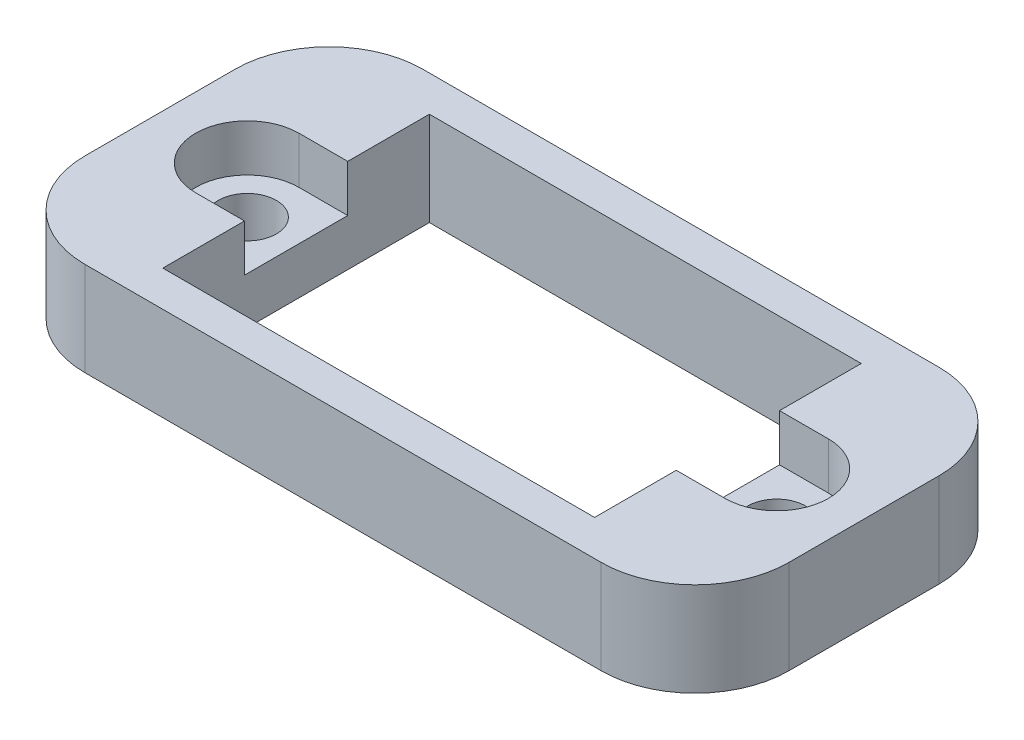
ISO-10303-21;
HEADER;
FILE_DESCRIPTION(('STEP AP214'),'2;1');
FILE_NAME('part.step','',(''),(''),'','','');
FILE_SCHEMA(('AUTOMOTIVE_DESIGN { 1 0 10303 214 1 1 1 1 }'));
ENDSEC;
DATA;
#1=APPLICATION_CONTEXT('core data for automotive mechanical design processes');
#2=APPLICATION_PROTOCOL_DEFINITION('international standard','automotive_design',2000,#1);
#3=PRODUCT_CONTEXT('',#1,'mechanical');
#4=PRODUCT('Part','Part','',(#3));
#5=PRODUCT_RELATED_PRODUCT_CATEGORY('part','',(#4));
#6=PRODUCT_DEFINITION_FORMATION('','',#4);
#7=PRODUCT_DEFINITION_CONTEXT('part definition',#1,'design');
#8=PRODUCT_DEFINITION('design','',#6,#7);
#9=PRODUCT_DEFINITION_SHAPE('','',#8);
#10=(LENGTH_UNIT() NAMED_UNIT(*) SI_UNIT(.MILLI.,.METRE.));
#11=(NAMED_UNIT(*) PLANE_ANGLE_UNIT() SI_UNIT($,.RADIAN.));
#12=(NAMED_UNIT(*) SI_UNIT($,.STERADIAN.) SOLID_ANGLE_UNIT());
#13=UNCERTAINTY_MEASURE_WITH_UNIT(LENGTH_MEASURE(1.E-05),#10,'distance_accuracy_value','');
#14=(GEOMETRIC_REPRESENTATION_CONTEXT(3) GLOBAL_UNCERTAINTY_ASSIGNED_CONTEXT((#13)) GLOBAL_UNIT_ASSIGNED_CONTEXT((#10,
#11,#12)) REPRESENTATION_CONTEXT('',''));
#15=CARTESIAN_POINT('',(0.,0.,0.));
#16=DIRECTION('',(0.,0.,1.));
#17=DIRECTION('',(1.,0.,0.));
#18=AXIS2_PLACEMENT_3D('',#15,#16,#17);
#19=CARTESIAN_POINT('',(-14.1,5.,0.));
#20=DIRECTION('',(0.,-1.,0.));
#21=DIRECTION('',(0.,0.,-1.));
#22=AXIS2_PLACEMENT_3D('',#19,#20,#21);
#23=CYLINDRICAL_SURFACE('',#22,1.55);
#24=CARTESIAN_POINT('',(-14.1,0.,0.));
#25=DIRECTION('',(0.,1.,0.));
#26=DIRECTION('',(0.,0.,1.));
#27=AXIS2_PLACEMENT_3D('',#24,#25,#26);
#28=CIRCLE('',#27,1.55);
#29=CARTESIAN_POINT('',(-14.1,0.,1.55));
#30=VERTEX_POINT('',#29);
#31=EDGE_CURVE('E266',#30,#30,#28,.T.);
#32=ORIENTED_EDGE('',*,*,#31,.F.);
#33=EDGE_LOOP('',(#32));
#34=FACE_BOUND('',#33,.T.);
#35=CARTESIAN_POINT('',(-14.1,2.5,0.));
#36=DIRECTION('',(0.,1.,0.));
#37=DIRECTION('',(0.,0.,1.));
#38=AXIS2_PLACEMENT_3D('',#35,#36,#37);
#39=CIRCLE('',#38,1.55);
#40=CARTESIAN_POINT('',(-14.1,2.5,1.55));
#41=VERTEX_POINT('',#40);
#42=EDGE_CURVE('E234',#41,#41,#39,.F.);
#43=ORIENTED_EDGE('',*,*,#42,.F.);
#44=EDGE_LOOP('',(#43));
#45=FACE_BOUND('',#44,.T.);
#46=ADVANCED_FACE('F39',(#34,#45),#23,.F.);
#47=CARTESIAN_POINT('',(14.1,5.,0.));
#48=DIRECTION('',(0.,-1.,0.));
#49=DIRECTION('',(0.,0.,-1.));
#50=AXIS2_PLACEMENT_3D('',#47,#48,#49);
#51=CYLINDRICAL_SURFACE('',#50,1.55);
#52=CARTESIAN_POINT('',(14.1,0.,0.));
#53=DIRECTION('',(0.,1.,0.));
#54=DIRECTION('',(0.,0.,1.));
#55=AXIS2_PLACEMENT_3D('',#52,#53,#54);
#56=CIRCLE('',#55,1.55);
#57=CARTESIAN_POINT('',(14.1,0.,1.55));
#58=VERTEX_POINT('',#57);
#59=EDGE_CURVE('E262',#58,#58,#56,.T.);
#60=ORIENTED_EDGE('',*,*,#59,.F.);
#61=EDGE_LOOP('',(#60));
#62=FACE_BOUND('',#61,.T.);
#63=CARTESIAN_POINT('',(14.1,2.5,0.));
#64=DIRECTION('',(0.,1.,0.));
#65=DIRECTION('',(0.,0.,1.));
#66=AXIS2_PLACEMENT_3D('',#63,#64,#65);
#67=CIRCLE('',#66,1.55);
#68=CARTESIAN_POINT('',(14.1,2.5,1.55));
#69=VERTEX_POINT('',#68);
#70=EDGE_CURVE('E209',#69,#69,#67,.F.);
#71=ORIENTED_EDGE('',*,*,#70,.F.);
#72=EDGE_LOOP('',(#71));
#73=FACE_BOUND('',#72,.T.);
#74=ADVANCED_FACE('F429',(#62,#73),#51,.F.);
#75=CARTESIAN_POINT('',(0.,5.,0.));
#76=DIRECTION('',(0.,-1.,0.));
#77=DIRECTION('',(0.,0.,-1.));
#78=AXIS2_PLACEMENT_3D('',#75,#76,#77);
#79=PLANE('',#78);
#80=DIRECTION('',(-1.,0.,0.));
#81=VECTOR('',#80,1.);
#82=CARTESIAN_POINT('',(-18.75,5.,-9.));
#83=LINE('',#82,#81);
#84=CARTESIAN_POINT('',(13.75,5.,-9.));
#85=VERTEX_POINT('',#84);
#86=CARTESIAN_POINT('',(-13.75,5.,-9.));
#87=VERTEX_POINT('',#86);
#88=EDGE_CURVE('E320',#85,#87,#83,.T.);
#89=ORIENTED_EDGE('',*,*,#88,.T.);
#90=CARTESIAN_POINT('',(-13.75,5.,-4.));
#91=DIRECTION('',(0.,-1.,0.));
#92=DIRECTION('',(0.,0.,-1.));
#93=AXIS2_PLACEMENT_3D('',#90,#91,#92);
#94=CIRCLE('',#93,5.);
#95=CARTESIAN_POINT('',(-18.75,5.,-4.));
#96=VERTEX_POINT('',#95);
#97=EDGE_CURVE('E378',#87,#96,#94,.F.);
#98=ORIENTED_EDGE('',*,*,#97,.T.);
#99=DIRECTION('',(0.,0.,1.));
#100=VECTOR('',#99,1.);
#101=CARTESIAN_POINT('',(-18.75,5.,9.));
#102=LINE('',#101,#100);
#103=CARTESIAN_POINT('',(-18.75,5.,4.));
#104=VERTEX_POINT('',#103);
#105=EDGE_CURVE('E325',#96,#104,#102,.T.);
#106=ORIENTED_EDGE('',*,*,#105,.T.);
#107=CARTESIAN_POINT('',(-13.75,5.,4.));
#108=DIRECTION('',(0.,-1.,0.));
#109=DIRECTION('',(0.,0.,-1.));
#110=AXIS2_PLACEMENT_3D('',#107,#108,#109);
#111=CIRCLE('',#110,5.);
#112=CARTESIAN_POINT('',(-13.75,5.,9.));
#113=VERTEX_POINT('',#112);
#114=EDGE_CURVE('E62',#104,#113,#111,.F.);
#115=ORIENTED_EDGE('',*,*,#114,.T.);
#116=DIRECTION('',(1.,0.,0.));
#117=VECTOR('',#116,1.);
#118=CARTESIAN_POINT('',(-18.75,5.,9.));
#119=LINE('',#118,#117);
#120=CARTESIAN_POINT('',(13.75,5.,9.));
#121=VERTEX_POINT('',#120);
#122=EDGE_CURVE('E328',#113,#121,#119,.T.);
#123=ORIENTED_EDGE('',*,*,#122,.T.);
#124=CARTESIAN_POINT('',(13.75,5.,4.));
#125=DIRECTION('',(0.,-1.,0.));
#126=DIRECTION('',(0.,0.,-1.));
#127=AXIS2_PLACEMENT_3D('',#124,#125,#126);
#128=CIRCLE('',#127,5.);
#129=CARTESIAN_POINT('',(18.75,5.,4.));
#130=VERTEX_POINT('',#129);
#131=EDGE_CURVE('E370',#121,#130,#128,.F.);
#132=ORIENTED_EDGE('',*,*,#131,.T.);
#133=DIRECTION('',(0.,0.,-1.));
#134=VECTOR('',#133,1.);
#135=CARTESIAN_POINT('',(18.75,5.,9.));
#136=LINE('',#135,#134);
#137=CARTESIAN_POINT('',(18.75,5.,-4.));
#138=VERTEX_POINT('',#137);
#139=EDGE_CURVE('E316',#130,#138,#136,.T.);
#140=ORIENTED_EDGE('',*,*,#139,.T.);
#141=CARTESIAN_POINT('',(13.75,5.,-4.));
#142=DIRECTION('',(0.,-1.,0.));
#143=DIRECTION('',(0.,0.,-1.));
#144=AXIS2_PLACEMENT_3D('',#141,#142,#143);
#145=CIRCLE('',#144,5.);
#146=EDGE_CURVE('E373',#138,#85,#145,.F.);
#147=ORIENTED_EDGE('',*,*,#146,.T.);
#148=EDGE_LOOP('',(#89,#98,#106,#115,#123,#132,#140,#147));
#149=FACE_BOUND('',#148,.T.);
#150=DIRECTION('',(0.,0.,-1.));
#151=VECTOR('',#150,1.);
#152=CARTESIAN_POINT('',(11.5,5.,7.1));
#153=LINE('',#152,#151);
#154=CARTESIAN_POINT('',(11.5,5.,-2.75));
#155=VERTEX_POINT('',#154);
#156=CARTESIAN_POINT('',(11.5,5.,-7.1));
#157=VERTEX_POINT('',#156);
#158=EDGE_CURVE('E275',#155,#157,#153,.T.);
#159=ORIENTED_EDGE('',*,*,#158,.F.);
#160=DIRECTION('',(-1.,0.,0.));
#161=VECTOR('',#160,1.);
#162=CARTESIAN_POINT('',(0.,5.,-2.74999999999999));
#163=LINE('',#162,#161);
#164=CARTESIAN_POINT('',(14.1,5.,-2.75));
#165=VERTEX_POINT('',#164);
#166=EDGE_CURVE('E201',#165,#155,#163,.T.);
#167=ORIENTED_EDGE('',*,*,#166,.F.);
#168=CARTESIAN_POINT('',(14.1,5.,0.));
#169=DIRECTION('',(0.,1.,0.));
#170=DIRECTION('',(0.,0.,1.));
#171=AXIS2_PLACEMENT_3D('',#168,#169,#170);
#172=CIRCLE('',#171,2.75);
#173=CARTESIAN_POINT('',(14.1,5.,2.74999999999999));
#174=VERTEX_POINT('',#173);
#175=EDGE_CURVE('E635',#174,#165,#172,.T.);
#176=ORIENTED_EDGE('',*,*,#175,.F.);
#177=DIRECTION('',(-1.,0.,0.));
#178=VECTOR('',#177,1.);
#179=CARTESIAN_POINT('',(0.,5.,2.75000000000002));
#180=LINE('',#179,#178);
#181=CARTESIAN_POINT('',(11.5,5.,2.75));
#182=VERTEX_POINT('',#181);
#183=EDGE_CURVE('E253',#174,#182,#180,.T.);
#184=ORIENTED_EDGE('',*,*,#183,.T.);
#185=CARTESIAN_POINT('',(11.5,5.,7.1));
#186=VERTEX_POINT('',#185);
#187=EDGE_CURVE('E207',#186,#182,#153,.T.);
#188=ORIENTED_EDGE('',*,*,#187,.F.);
#189=DIRECTION('',(1.,0.,0.));
#190=VECTOR('',#189,1.);
#191=CARTESIAN_POINT('',(-11.5,5.,7.1));
#192=LINE('',#191,#190);
#193=CARTESIAN_POINT('',(-11.5,5.,7.1));
#194=VERTEX_POINT('',#193);
#195=EDGE_CURVE('E283',#194,#186,#192,.T.);
#196=ORIENTED_EDGE('',*,*,#195,.F.);
#197=DIRECTION('',(0.,0.,1.));
#198=VECTOR('',#197,1.);
#199=CARTESIAN_POINT('',(-11.5,5.,7.1));
#200=LINE('',#199,#198);
#201=CARTESIAN_POINT('',(-11.5,5.,2.75));
#202=VERTEX_POINT('',#201);
#203=EDGE_CURVE('E278',#202,#194,#200,.T.);
#204=ORIENTED_EDGE('',*,*,#203,.F.);
#205=DIRECTION('',(1.,0.,0.));
#206=VECTOR('',#205,1.);
#207=CARTESIAN_POINT('',(0.,5.,2.75));
#208=LINE('',#207,#206);
#209=CARTESIAN_POINT('',(-14.1,5.,2.75));
#210=VERTEX_POINT('',#209);
#211=EDGE_CURVE('E224',#210,#202,#208,.T.);
#212=ORIENTED_EDGE('',*,*,#211,.F.);
#213=CARTESIAN_POINT('',(-14.1,5.,0.));
#214=DIRECTION('',(0.,1.,0.));
#215=DIRECTION('',(0.,0.,1.));
#216=AXIS2_PLACEMENT_3D('',#213,#214,#215);
#217=CIRCLE('',#216,2.75);
#218=CARTESIAN_POINT('',(-14.1,5.,-2.75));
#219=VERTEX_POINT('',#218);
#220=EDGE_CURVE('E243',#219,#210,#217,.T.);
#221=ORIENTED_EDGE('',*,*,#220,.F.);
#222=DIRECTION('',(1.,0.,0.));
#223=VECTOR('',#222,1.);
#224=CARTESIAN_POINT('',(0.,5.,-2.75));
#225=LINE('',#224,#223);
#226=CARTESIAN_POINT('',(-11.5,5.,-2.75));
#227=VERTEX_POINT('',#226);
#228=EDGE_CURVE('E239',#219,#227,#225,.T.);
#229=ORIENTED_EDGE('',*,*,#228,.T.);
#230=CARTESIAN_POINT('',(-11.5,5.,-7.1));
#231=VERTEX_POINT('',#230);
#232=EDGE_CURVE('E279',#231,#227,#200,.T.);
#233=ORIENTED_EDGE('',*,*,#232,.F.);
#234=DIRECTION('',(-1.,0.,0.));
#235=VECTOR('',#234,1.);
#236=CARTESIAN_POINT('',(-11.5,5.,-7.1));
#237=LINE('',#236,#235);
#238=EDGE_CURVE('E274',#157,#231,#237,.T.);
#239=ORIENTED_EDGE('',*,*,#238,.F.);
#240=EDGE_LOOP('',(#159,#167,#176,#184,#188,#196,#204,#212,#221,#229,#233,#239));
#241=FACE_BOUND('',#240,.T.);
#242=ADVANCED_FACE('F411',(#149,#241),#79,.F.);
#243=CARTESIAN_POINT('',(0.,0.,0.));
#244=DIRECTION('',(0.,-1.,0.));
#245=DIRECTION('',(0.,0.,-1.));
#246=AXIS2_PLACEMENT_3D('',#243,#244,#245);
#247=PLANE('',#246);
#248=ORIENTED_EDGE('',*,*,#31,.T.);
#249=EDGE_LOOP('',(#248));
#250=FACE_BOUND('',#249,.T.);
#251=DIRECTION('',(0.,0.,1.));
#252=VECTOR('',#251,1.);
#253=CARTESIAN_POINT('',(-18.75,0.,9.));
#254=LINE('',#253,#252);
#255=CARTESIAN_POINT('',(-18.75,0.,-4.));
#256=VERTEX_POINT('',#255);
#257=CARTESIAN_POINT('',(-18.75,0.,4.));
#258=VERTEX_POINT('',#257);
#259=EDGE_CURVE('E339',#256,#258,#254,.T.);
#260=ORIENTED_EDGE('',*,*,#259,.F.);
#261=CARTESIAN_POINT('',(-13.75,0.,-4.));
#262=DIRECTION('',(0.,-1.,0.));
#263=DIRECTION('',(0.,0.,-1.));
#264=AXIS2_PLACEMENT_3D('',#261,#262,#263);
#265=CIRCLE('',#264,5.);
#266=CARTESIAN_POINT('',(-13.75,0.,-9.));
#267=VERTEX_POINT('',#266);
#268=EDGE_CURVE('E360',#256,#267,#265,.T.);
#269=ORIENTED_EDGE('',*,*,#268,.T.);
#270=DIRECTION('',(-1.,0.,0.));
#271=VECTOR('',#270,1.);
#272=CARTESIAN_POINT('',(-18.75,0.,-9.));
#273=LINE('',#272,#271);
#274=CARTESIAN_POINT('',(13.75,0.,-9.));
#275=VERTEX_POINT('',#274);
#276=EDGE_CURVE('E335',#275,#267,#273,.T.);
#277=ORIENTED_EDGE('',*,*,#276,.F.);
#278=CARTESIAN_POINT('',(13.75,0.,-4.));
#279=DIRECTION('',(0.,-1.,0.));
#280=DIRECTION('',(0.,0.,-1.));
#281=AXIS2_PLACEMENT_3D('',#278,#279,#280);
#282=CIRCLE('',#281,5.);
#283=CARTESIAN_POINT('',(18.75,0.,-4.));
#284=VERTEX_POINT('',#283);
#285=EDGE_CURVE('E354',#275,#284,#282,.T.);
#286=ORIENTED_EDGE('',*,*,#285,.T.);
#287=DIRECTION('',(0.,0.,-1.));
#288=VECTOR('',#287,1.);
#289=CARTESIAN_POINT('',(18.75,0.,9.));
#290=LINE('',#289,#288);
#291=CARTESIAN_POINT('',(18.75,0.,4.));
#292=VERTEX_POINT('',#291);
#293=EDGE_CURVE('E315',#292,#284,#290,.T.);
#294=ORIENTED_EDGE('',*,*,#293,.F.);
#295=CARTESIAN_POINT('',(13.75,0.,4.));
#296=DIRECTION('',(0.,-1.,0.));
#297=DIRECTION('',(0.,0.,-1.));
#298=AXIS2_PLACEMENT_3D('',#295,#296,#297);
#299=CIRCLE('',#298,5.);
#300=CARTESIAN_POINT('',(13.75,0.,9.));
#301=VERTEX_POINT('',#300);
#302=EDGE_CURVE('E351',#292,#301,#299,.T.);
#303=ORIENTED_EDGE('',*,*,#302,.T.);
#304=DIRECTION('',(1.,0.,0.));
#305=VECTOR('',#304,1.);
#306=CARTESIAN_POINT('',(-18.75,0.,9.));
#307=LINE('',#306,#305);
#308=CARTESIAN_POINT('',(-13.75,0.,9.));
#309=VERTEX_POINT('',#308);
#310=EDGE_CURVE('E321',#309,#301,#307,.T.);
#311=ORIENTED_EDGE('',*,*,#310,.F.);
#312=CARTESIAN_POINT('',(-13.75,0.,4.));
#313=DIRECTION('',(0.,-1.,0.));
#314=DIRECTION('',(0.,0.,-1.));
#315=AXIS2_PLACEMENT_3D('',#312,#313,#314);
#316=CIRCLE('',#315,5.);
#317=EDGE_CURVE('E357',#309,#258,#316,.T.);
#318=ORIENTED_EDGE('',*,*,#317,.T.);
#319=EDGE_LOOP('',(#260,#269,#277,#286,#294,#303,#311,#318));
#320=FACE_BOUND('',#319,.T.);
#321=DIRECTION('',(1.,0.,0.));
#322=VECTOR('',#321,1.);
#323=CARTESIAN_POINT('',(-11.5,0.,7.1));
#324=LINE('',#323,#322);
#325=CARTESIAN_POINT('',(-11.5,0.,7.1));
#326=VERTEX_POINT('',#325);
#327=CARTESIAN_POINT('',(11.5,0.,7.1));
#328=VERTEX_POINT('',#327);
#329=EDGE_CURVE('E298',#326,#328,#324,.T.);
#330=ORIENTED_EDGE('',*,*,#329,.T.);
#331=DIRECTION('',(0.,0.,-1.));
#332=VECTOR('',#331,1.);
#333=CARTESIAN_POINT('',(11.5,0.,7.1));
#334=LINE('',#333,#332);
#335=CARTESIAN_POINT('',(11.5,0.,-7.1));
#336=VERTEX_POINT('',#335);
#337=EDGE_CURVE('E271',#328,#336,#334,.T.);
#338=ORIENTED_EDGE('',*,*,#337,.T.);
#339=DIRECTION('',(-1.,0.,0.));
#340=VECTOR('',#339,1.);
#341=CARTESIAN_POINT('',(-11.5,0.,-7.1));
#342=LINE('',#341,#340);
#343=CARTESIAN_POINT('',(-11.5,0.,-7.1));
#344=VERTEX_POINT('',#343);
#345=EDGE_CURVE('E290',#336,#344,#342,.T.);
#346=ORIENTED_EDGE('',*,*,#345,.T.);
#347=DIRECTION('',(0.,0.,1.));
#348=VECTOR('',#347,1.);
#349=CARTESIAN_POINT('',(-11.5,0.,7.1));
#350=LINE('',#349,#348);
#351=EDGE_CURVE('E294',#344,#326,#350,.T.);
#352=ORIENTED_EDGE('',*,*,#351,.T.);
#353=EDGE_LOOP('',(#330,#338,#346,#352));
#354=FACE_BOUND('',#353,.T.);
#355=ORIENTED_EDGE('',*,*,#59,.T.);
#356=EDGE_LOOP('',(#355));
#357=FACE_BOUND('',#356,.T.);
#358=ADVANCED_FACE('F398',(#250,#320,#354,#357),#247,.T.);
#359=CARTESIAN_POINT('',(18.75,5.,9.));
#360=DIRECTION('',(-1.,0.,0.));
#361=DIRECTION('',(0.,0.,1.));
#362=AXIS2_PLACEMENT_3D('',#359,#360,#361);
#363=PLANE('',#362);
#364=ORIENTED_EDGE('',*,*,#293,.T.);
#365=DIRECTION('',(0.,-1.,0.));
#366=VECTOR('',#365,1.);
#367=CARTESIAN_POINT('',(18.75,5.,-4.));
#368=LINE('',#367,#366);
#369=EDGE_CURVE('E11',#284,#138,#368,.F.);
#370=ORIENTED_EDGE('',*,*,#369,.T.);
#371=ORIENTED_EDGE('',*,*,#139,.F.);
#372=DIRECTION('',(0.,-1.,0.));
#373=VECTOR('',#372,1.);
#374=CARTESIAN_POINT('',(18.75,5.,4.));
#375=LINE('',#374,#373);
#376=EDGE_CURVE('E48',#130,#292,#375,.T.);
#377=ORIENTED_EDGE('',*,*,#376,.T.);
#378=EDGE_LOOP('',(#364,#370,#371,#377));
#379=FACE_BOUND('',#378,.T.);
#380=ADVANCED_FACE('F392',(#379),#363,.F.);
#381=CARTESIAN_POINT('',(-18.75,5.,-9.));
#382=DIRECTION('',(0.,0.,1.));
#383=DIRECTION('',(1.,0.,0.));
#384=AXIS2_PLACEMENT_3D('',#381,#382,#383);
#385=PLANE('',#384);
#386=ORIENTED_EDGE('',*,*,#276,.T.);
#387=DIRECTION('',(0.,-1.,0.));
#388=VECTOR('',#387,1.);
#389=CARTESIAN_POINT('',(-13.75,5.,-9.));
#390=LINE('',#389,#388);
#391=EDGE_CURVE('E367',#267,#87,#390,.F.);
#392=ORIENTED_EDGE('',*,*,#391,.T.);
#393=ORIENTED_EDGE('',*,*,#88,.F.);
#394=DIRECTION('',(0.,-1.,0.));
#395=VECTOR('',#394,1.);
#396=CARTESIAN_POINT('',(13.75,5.,-9.));
#397=LINE('',#396,#395);
#398=EDGE_CURVE('E363',#85,#275,#397,.T.);
#399=ORIENTED_EDGE('',*,*,#398,.T.);
#400=EDGE_LOOP('',(#386,#392,#393,#399));
#401=FACE_BOUND('',#400,.T.);
#402=ADVANCED_FACE('F408',(#401),#385,.F.);
#403=CARTESIAN_POINT('',(-18.75,5.,9.));
#404=DIRECTION('',(1.,0.,0.));
#405=DIRECTION('',(0.,0.,-1.));
#406=AXIS2_PLACEMENT_3D('',#403,#404,#405);
#407=PLANE('',#406);
#408=ORIENTED_EDGE('',*,*,#105,.F.);
#409=DIRECTION('',(0.,-1.,0.));
#410=VECTOR('',#409,1.);
#411=CARTESIAN_POINT('',(-18.75,5.,-4.));
#412=LINE('',#411,#410);
#413=EDGE_CURVE('E347',#96,#256,#412,.T.);
#414=ORIENTED_EDGE('',*,*,#413,.T.);
#415=ORIENTED_EDGE('',*,*,#259,.T.);
#416=DIRECTION('',(0.,-1.,0.));
#417=VECTOR('',#416,1.);
#418=CARTESIAN_POINT('',(-18.75,5.,4.));
#419=LINE('',#418,#417);
#420=EDGE_CURVE('E331',#258,#104,#419,.F.);
#421=ORIENTED_EDGE('',*,*,#420,.T.);
#422=EDGE_LOOP('',(#408,#414,#415,#421));
#423=FACE_BOUND('',#422,.T.);
#424=ADVANCED_FACE('F418',(#423),#407,.F.);
#425=CARTESIAN_POINT('',(-18.75,5.,9.));
#426=DIRECTION('',(0.,0.,-1.));
#427=DIRECTION('',(-1.,0.,0.));
#428=AXIS2_PLACEMENT_3D('',#425,#426,#427);
#429=PLANE('',#428);
#430=ORIENTED_EDGE('',*,*,#122,.F.);
#431=DIRECTION('',(0.,-1.,0.));
#432=VECTOR('',#431,1.);
#433=CARTESIAN_POINT('',(-13.75,5.,9.));
#434=LINE('',#433,#432);
#435=EDGE_CURVE('E383',#113,#309,#434,.T.);
#436=ORIENTED_EDGE('',*,*,#435,.T.);
#437=ORIENTED_EDGE('',*,*,#310,.T.);
#438=DIRECTION('',(0.,-1.,0.));
#439=VECTOR('',#438,1.);
#440=CARTESIAN_POINT('',(13.75,5.,9.));
#441=LINE('',#440,#439);
#442=EDGE_CURVE('E55',#301,#121,#441,.F.);
#443=ORIENTED_EDGE('',*,*,#442,.T.);
#444=EDGE_LOOP('',(#430,#436,#437,#443));
#445=FACE_BOUND('',#444,.T.);
#446=ADVANCED_FACE('F423',(#445),#429,.F.);
#447=CARTESIAN_POINT('',(11.5,5.,7.1));
#448=DIRECTION('',(-1.,0.,0.));
#449=DIRECTION('',(0.,0.,1.));
#450=AXIS2_PLACEMENT_3D('',#447,#448,#449);
#451=PLANE('',#450);
#452=DIRECTION('',(0.,1.,0.));
#453=VECTOR('',#452,1.);
#454=CARTESIAN_POINT('',(11.5,2.5,-2.75));
#455=LINE('',#454,#453);
#456=CARTESIAN_POINT('',(11.5,2.5,-2.75));
#457=VERTEX_POINT('',#456);
#458=EDGE_CURVE('E267',#457,#155,#455,.T.);
#459=ORIENTED_EDGE('',*,*,#458,.T.);
#460=ORIENTED_EDGE('',*,*,#158,.T.);
#461=DIRECTION('',(0.,-1.,0.));
#462=VECTOR('',#461,1.);
#463=CARTESIAN_POINT('',(11.5,5.,-7.1));
#464=LINE('',#463,#462);
#465=EDGE_CURVE('E311',#157,#336,#464,.T.);
#466=ORIENTED_EDGE('',*,*,#465,.T.);
#467=ORIENTED_EDGE('',*,*,#337,.F.);
#468=DIRECTION('',(0.,-1.,0.));
#469=VECTOR('',#468,1.);
#470=CARTESIAN_POINT('',(11.5,5.,7.1));
#471=LINE('',#470,#469);
#472=EDGE_CURVE('E286',#186,#328,#471,.T.);
#473=ORIENTED_EDGE('',*,*,#472,.F.);
#474=ORIENTED_EDGE('',*,*,#187,.T.);
#475=DIRECTION('',(0.,1.,0.));
#476=VECTOR('',#475,1.);
#477=CARTESIAN_POINT('',(11.5,2.5,2.75));
#478=LINE('',#477,#476);
#479=CARTESIAN_POINT('',(11.5,2.5,2.75));
#480=VERTEX_POINT('',#479);
#481=EDGE_CURVE('E182',#480,#182,#478,.T.);
#482=ORIENTED_EDGE('',*,*,#481,.F.);
#483=DIRECTION('',(0.,0.,1.));
#484=VECTOR('',#483,1.);
#485=CARTESIAN_POINT('',(11.5,2.5,0.));
#486=LINE('',#485,#484);
#487=EDGE_CURVE('E190',#457,#480,#486,.T.);
#488=ORIENTED_EDGE('',*,*,#487,.F.);
#489=EDGE_LOOP('',(#459,#460,#466,#467,#473,#474,#482,#488));
#490=FACE_BOUND('',#489,.T.);
#491=ADVANCED_FACE('F204',(#490),#451,.T.);
#492=CARTESIAN_POINT('',(-11.5,5.,-7.1));
#493=DIRECTION('',(0.,0.,1.));
#494=DIRECTION('',(1.,0.,0.));
#495=AXIS2_PLACEMENT_3D('',#492,#493,#494);
#496=PLANE('',#495);
#497=ORIENTED_EDGE('',*,*,#345,.F.);
#498=ORIENTED_EDGE('',*,*,#465,.F.);
#499=ORIENTED_EDGE('',*,*,#238,.T.);
#500=DIRECTION('',(0.,-1.,0.));
#501=VECTOR('',#500,1.);
#502=CARTESIAN_POINT('',(-11.5,5.,-7.1));
#503=LINE('',#502,#501);
#504=EDGE_CURVE('E308',#231,#344,#503,.T.);
#505=ORIENTED_EDGE('',*,*,#504,.T.);
#506=EDGE_LOOP('',(#497,#498,#499,#505));
#507=FACE_BOUND('',#506,.T.);
#508=ADVANCED_FACE('F449',(#507),#496,.T.);
#509=CARTESIAN_POINT('',(-11.5,5.,7.1));
#510=DIRECTION('',(1.,0.,0.));
#511=DIRECTION('',(0.,0.,-1.));
#512=AXIS2_PLACEMENT_3D('',#509,#510,#511);
#513=PLANE('',#512);
#514=DIRECTION('',(0.,1.,0.));
#515=VECTOR('',#514,1.);
#516=CARTESIAN_POINT('',(-11.5,2.5,2.75));
#517=LINE('',#516,#515);
#518=CARTESIAN_POINT('',(-11.5,2.5,2.75));
#519=VERTEX_POINT('',#518);
#520=EDGE_CURVE('E249',#519,#202,#517,.T.);
#521=ORIENTED_EDGE('',*,*,#520,.T.);
#522=ORIENTED_EDGE('',*,*,#203,.T.);
#523=DIRECTION('',(0.,-1.,0.));
#524=VECTOR('',#523,1.);
#525=CARTESIAN_POINT('',(-11.5,5.,7.1));
#526=LINE('',#525,#524);
#527=EDGE_CURVE('E305',#194,#326,#526,.T.);
#528=ORIENTED_EDGE('',*,*,#527,.T.);
#529=ORIENTED_EDGE('',*,*,#351,.F.);
#530=ORIENTED_EDGE('',*,*,#504,.F.);
#531=ORIENTED_EDGE('',*,*,#232,.T.);
#532=DIRECTION('',(0.,1.,0.));
#533=VECTOR('',#532,1.);
#534=CARTESIAN_POINT('',(-11.5,2.5,-2.75));
#535=LINE('',#534,#533);
#536=CARTESIAN_POINT('',(-11.5,2.5,-2.75));
#537=VERTEX_POINT('',#536);
#538=EDGE_CURVE('E238',#537,#227,#535,.T.);
#539=ORIENTED_EDGE('',*,*,#538,.F.);
#540=DIRECTION('',(0.,0.,-1.));
#541=VECTOR('',#540,1.);
#542=CARTESIAN_POINT('',(-11.5,2.5,0.));
#543=LINE('',#542,#541);
#544=EDGE_CURVE('E219',#519,#537,#543,.T.);
#545=ORIENTED_EDGE('',*,*,#544,.F.);
#546=EDGE_LOOP('',(#521,#522,#528,#529,#530,#531,#539,#545));
#547=FACE_BOUND('',#546,.T.);
#548=ADVANCED_FACE('F445',(#547),#513,.T.);
#549=CARTESIAN_POINT('',(-11.5,5.,7.1));
#550=DIRECTION('',(0.,0.,-1.));
#551=DIRECTION('',(-1.,0.,0.));
#552=AXIS2_PLACEMENT_3D('',#549,#550,#551);
#553=PLANE('',#552);
#554=ORIENTED_EDGE('',*,*,#329,.F.);
#555=ORIENTED_EDGE('',*,*,#527,.F.);
#556=ORIENTED_EDGE('',*,*,#195,.T.);
#557=ORIENTED_EDGE('',*,*,#472,.T.);
#558=EDGE_LOOP('',(#554,#555,#556,#557));
#559=FACE_BOUND('',#558,.T.);
#560=ADVANCED_FACE('F441',(#559),#553,.T.);
#561=CARTESIAN_POINT('',(0.,2.5,-2.74999999999999));
#562=DIRECTION('',(0.,0.,-1.));
#563=DIRECTION('',(-1.,0.,0.));
#564=AXIS2_PLACEMENT_3D('',#561,#562,#563);
#565=PLANE('',#564);
#566=ORIENTED_EDGE('',*,*,#166,.T.);
#567=ORIENTED_EDGE('',*,*,#458,.F.);
#568=DIRECTION('',(-1.,0.,0.));
#569=VECTOR('',#568,1.);
#570=CARTESIAN_POINT('',(0.,2.5,-2.74999999999999));
#571=LINE('',#570,#569);
#572=CARTESIAN_POINT('',(14.1,2.5,-2.75));
#573=VERTEX_POINT('',#572);
#574=EDGE_CURVE('E196',#573,#457,#571,.T.);
#575=ORIENTED_EDGE('',*,*,#574,.F.);
#576=DIRECTION('',(0.,1.,0.));
#577=VECTOR('',#576,1.);
#578=CARTESIAN_POINT('',(14.1,2.5,-2.75));
#579=LINE('',#578,#577);
#580=EDGE_CURVE('E213',#573,#165,#579,.T.);
#581=ORIENTED_EDGE('',*,*,#580,.T.);
#582=EDGE_LOOP('',(#566,#567,#575,#581));
#583=FACE_BOUND('',#582,.T.);
#584=ADVANCED_FACE('F444',(#583),#565,.F.);
#585=CARTESIAN_POINT('',(14.1,2.5,0.));
#586=DIRECTION('',(0.,1.,0.));
#587=DIRECTION('',(0.,0.,1.));
#588=AXIS2_PLACEMENT_3D('',#585,#586,#587);
#589=CYLINDRICAL_SURFACE('',#588,2.75);
#590=ORIENTED_EDGE('',*,*,#175,.T.);
#591=ORIENTED_EDGE('',*,*,#580,.F.);
#592=CARTESIAN_POINT('',(14.1,2.5,0.));
#593=DIRECTION('',(0.,1.,0.));
#594=DIRECTION('',(0.,0.,1.));
#595=AXIS2_PLACEMENT_3D('',#592,#593,#594);
#596=CIRCLE('',#595,2.75);
#597=CARTESIAN_POINT('',(14.1,2.5,2.74999999999999));
#598=VERTEX_POINT('',#597);
#599=EDGE_CURVE('E189',#598,#573,#596,.T.);
#600=ORIENTED_EDGE('',*,*,#599,.F.);
#601=DIRECTION('',(0.,1.,0.));
#602=VECTOR('',#601,1.);
#603=CARTESIAN_POINT('',(14.1,2.5,2.74999999999999));
#604=LINE('',#603,#602);
#605=EDGE_CURVE('E184',#598,#174,#604,.T.);
#606=ORIENTED_EDGE('',*,*,#605,.T.);
#607=EDGE_LOOP('',(#590,#591,#600,#606));
#608=FACE_BOUND('',#607,.T.);
#609=ADVANCED_FACE('F571',(#608),#589,.F.);
#610=CARTESIAN_POINT('',(0.,2.5,2.75000000000002));
#611=DIRECTION('',(0.,0.,-1.));
#612=DIRECTION('',(-1.,0.,0.));
#613=AXIS2_PLACEMENT_3D('',#610,#611,#612);
#614=PLANE('',#613);
#615=ORIENTED_EDGE('',*,*,#183,.F.);
#616=ORIENTED_EDGE('',*,*,#605,.F.);
#617=DIRECTION('',(-1.,0.,0.));
#618=VECTOR('',#617,1.);
#619=CARTESIAN_POINT('',(0.,2.5,2.75000000000002));
#620=LINE('',#619,#618);
#621=EDGE_CURVE('E177',#598,#480,#620,.T.);
#622=ORIENTED_EDGE('',*,*,#621,.T.);
#623=ORIENTED_EDGE('',*,*,#481,.T.);
#624=EDGE_LOOP('',(#615,#616,#622,#623));
#625=FACE_BOUND('',#624,.T.);
#626=ADVANCED_FACE('F180',(#625),#614,.T.);
#627=CARTESIAN_POINT('',(0.,2.5,0.));
#628=DIRECTION('',(0.,1.,0.));
#629=DIRECTION('',(0.,0.,1.));
#630=AXIS2_PLACEMENT_3D('',#627,#628,#629);
#631=PLANE('',#630);
#632=ORIENTED_EDGE('',*,*,#487,.T.);
#633=ORIENTED_EDGE('',*,*,#621,.F.);
#634=ORIENTED_EDGE('',*,*,#599,.T.);
#635=ORIENTED_EDGE('',*,*,#574,.T.);
#636=EDGE_LOOP('',(#632,#633,#634,#635));
#637=FACE_BOUND('',#636,.T.);
#638=ORIENTED_EDGE('',*,*,#70,.T.);
#639=EDGE_LOOP('',(#638));
#640=FACE_BOUND('',#639,.T.);
#641=ADVANCED_FACE('F193',(#637,#640),#631,.T.);
#642=CARTESIAN_POINT('',(0.,2.5,2.75));
#643=DIRECTION('',(0.,0.,1.));
#644=DIRECTION('',(1.,0.,0.));
#645=AXIS2_PLACEMENT_3D('',#642,#643,#644);
#646=PLANE('',#645);
#647=ORIENTED_EDGE('',*,*,#211,.T.);
#648=ORIENTED_EDGE('',*,*,#520,.F.);
#649=DIRECTION('',(1.,0.,0.));
#650=VECTOR('',#649,1.);
#651=CARTESIAN_POINT('',(0.,2.5,2.75));
#652=LINE('',#651,#650);
#653=CARTESIAN_POINT('',(-14.1,2.5,2.75));
#654=VERTEX_POINT('',#653);
#655=EDGE_CURVE('E231',#654,#519,#652,.T.);
#656=ORIENTED_EDGE('',*,*,#655,.F.);
#657=DIRECTION('',(0.,1.,0.));
#658=VECTOR('',#657,1.);
#659=CARTESIAN_POINT('',(-14.1,2.5,2.75));
#660=LINE('',#659,#658);
#661=EDGE_CURVE('E254',#654,#210,#660,.T.);
#662=ORIENTED_EDGE('',*,*,#661,.T.);
#663=EDGE_LOOP('',(#647,#648,#656,#662));
#664=FACE_BOUND('',#663,.T.);
#665=ADVANCED_FACE('F592',(#664),#646,.F.);
#666=CARTESIAN_POINT('',(-14.1,2.5,0.));
#667=DIRECTION('',(0.,1.,0.));
#668=DIRECTION('',(0.,0.,1.));
#669=AXIS2_PLACEMENT_3D('',#666,#667,#668);
#670=CYLINDRICAL_SURFACE('',#669,2.75);
#671=ORIENTED_EDGE('',*,*,#220,.T.);
#672=ORIENTED_EDGE('',*,*,#661,.F.);
#673=CARTESIAN_POINT('',(-14.1,2.5,0.));
#674=DIRECTION('',(0.,1.,0.));
#675=DIRECTION('',(0.,0.,1.));
#676=AXIS2_PLACEMENT_3D('',#673,#674,#675);
#677=CIRCLE('',#676,2.75);
#678=CARTESIAN_POINT('',(-14.1,2.5,-2.75));
#679=VERTEX_POINT('',#678);
#680=EDGE_CURVE('E227',#679,#654,#677,.T.);
#681=ORIENTED_EDGE('',*,*,#680,.F.);
#682=DIRECTION('',(0.,1.,0.));
#683=VECTOR('',#682,1.);
#684=CARTESIAN_POINT('',(-14.1,2.5,-2.75));
#685=LINE('',#684,#683);
#686=EDGE_CURVE('E257',#679,#219,#685,.T.);
#687=ORIENTED_EDGE('',*,*,#686,.T.);
#688=EDGE_LOOP('',(#671,#672,#681,#687));
#689=FACE_BOUND('',#688,.T.);
#690=ADVANCED_FACE('F599',(#689),#670,.F.);
#691=CARTESIAN_POINT('',(0.,2.5,-2.75));
#692=DIRECTION('',(0.,0.,1.));
#693=DIRECTION('',(1.,0.,0.));
#694=AXIS2_PLACEMENT_3D('',#691,#692,#693);
#695=PLANE('',#694);
#696=ORIENTED_EDGE('',*,*,#228,.F.);
#697=ORIENTED_EDGE('',*,*,#686,.F.);
#698=DIRECTION('',(1.,0.,0.));
#699=VECTOR('',#698,1.);
#700=CARTESIAN_POINT('',(0.,2.5,-2.75));
#701=LINE('',#700,#699);
#702=EDGE_CURVE('E223',#679,#537,#701,.T.);
#703=ORIENTED_EDGE('',*,*,#702,.T.);
#704=ORIENTED_EDGE('',*,*,#538,.T.);
#705=EDGE_LOOP('',(#696,#697,#703,#704));
#706=FACE_BOUND('',#705,.T.);
#707=ADVANCED_FACE('F502',(#706),#695,.T.);
#708=CARTESIAN_POINT('',(0.,2.5,0.));
#709=DIRECTION('',(0.,1.,0.));
#710=DIRECTION('',(0.,0.,1.));
#711=AXIS2_PLACEMENT_3D('',#708,#709,#710);
#712=PLANE('',#711);
#713=ORIENTED_EDGE('',*,*,#544,.T.);
#714=ORIENTED_EDGE('',*,*,#702,.F.);
#715=ORIENTED_EDGE('',*,*,#680,.T.);
#716=ORIENTED_EDGE('',*,*,#655,.T.);
#717=EDGE_LOOP('',(#713,#714,#715,#716));
#718=FACE_BOUND('',#717,.T.);
#719=ORIENTED_EDGE('',*,*,#42,.T.);
#720=EDGE_LOOP('',(#719));
#721=FACE_BOUND('',#720,.T.);
#722=ADVANCED_FACE('F471',(#718,#721),#712,.T.);
#723=CARTESIAN_POINT('',(-13.75,5.,-4.));
#724=DIRECTION('',(0.,-1.,0.));
#725=DIRECTION('',(0.,0.,-1.));
#726=AXIS2_PLACEMENT_3D('',#723,#724,#725);
#727=CYLINDRICAL_SURFACE('',#726,5.);
#728=ORIENTED_EDGE('',*,*,#97,.F.);
#729=ORIENTED_EDGE('',*,*,#391,.F.);
#730=ORIENTED_EDGE('',*,*,#268,.F.);
#731=ORIENTED_EDGE('',*,*,#413,.F.);
#732=EDGE_LOOP('',(#728,#729,#730,#731));
#733=FACE_BOUND('',#732,.T.);
#734=ADVANCED_FACE('F416',(#733),#727,.T.);
#735=CARTESIAN_POINT('',(-13.75,5.,4.));
#736=DIRECTION('',(0.,-1.,0.));
#737=DIRECTION('',(0.,0.,-1.));
#738=AXIS2_PLACEMENT_3D('',#735,#736,#737);
#739=CYLINDRICAL_SURFACE('',#738,5.);
#740=ORIENTED_EDGE('',*,*,#114,.F.);
#741=ORIENTED_EDGE('',*,*,#420,.F.);
#742=ORIENTED_EDGE('',*,*,#317,.F.);
#743=ORIENTED_EDGE('',*,*,#435,.F.);
#744=EDGE_LOOP('',(#740,#741,#742,#743));
#745=FACE_BOUND('',#744,.T.);
#746=ADVANCED_FACE('F422',(#745),#739,.T.);
#747=CARTESIAN_POINT('',(13.75,5.,-4.));
#748=DIRECTION('',(0.,-1.,0.));
#749=DIRECTION('',(0.,0.,-1.));
#750=AXIS2_PLACEMENT_3D('',#747,#748,#749);
#751=CYLINDRICAL_SURFACE('',#750,5.);
#752=ORIENTED_EDGE('',*,*,#146,.F.);
#753=ORIENTED_EDGE('',*,*,#369,.F.);
#754=ORIENTED_EDGE('',*,*,#285,.F.);
#755=ORIENTED_EDGE('',*,*,#398,.F.);
#756=EDGE_LOOP('',(#752,#753,#754,#755));
#757=FACE_BOUND('',#756,.T.);
#758=ADVANCED_FACE('F405',(#757),#751,.T.);
#759=CARTESIAN_POINT('',(13.75,5.,4.));
#760=DIRECTION('',(0.,-1.,0.));
#761=DIRECTION('',(0.,0.,-1.));
#762=AXIS2_PLACEMENT_3D('',#759,#760,#761);
#763=CYLINDRICAL_SURFACE('',#762,5.);
#764=ORIENTED_EDGE('',*,*,#131,.F.);
#765=ORIENTED_EDGE('',*,*,#442,.F.);
#766=ORIENTED_EDGE('',*,*,#302,.F.);
#767=ORIENTED_EDGE('',*,*,#376,.F.);
#768=EDGE_LOOP('',(#764,#765,#766,#767));
#769=FACE_BOUND('',#768,.T.);
#770=ADVANCED_FACE('F41',(#769),#763,.T.);
#771=CLOSED_SHELL('',(#46,#74,#242,#358,#380,#402,#424,#446,#491,#508,#548,#560,#584,#609,#626,
#641,#665,#690,#707,#722,#734,#746,#758,#770));
#772=MANIFOLD_SOLID_BREP('B2',#771);
#773=ADVANCED_BREP_SHAPE_REPRESENTATION('',(#18,#772),#14);
#774=SHAPE_DEFINITION_REPRESENTATION(#9,#773);
ENDSEC;
END-ISO-10303-21;
